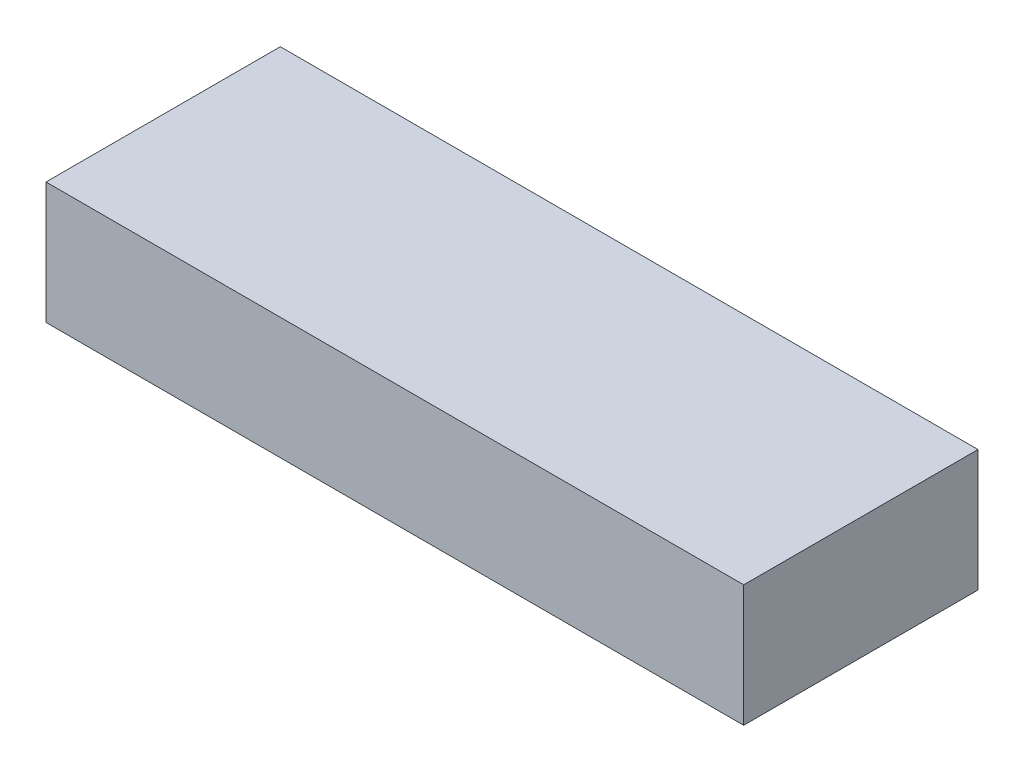
ISO-10303-21;
HEADER;
FILE_DESCRIPTION(('STEP AP214'),'2;1');
FILE_NAME('part.step','',(''),(''),'','','');
FILE_SCHEMA(('AUTOMOTIVE_DESIGN { 1 0 10303 214 1 1 1 1 }'));
ENDSEC;
DATA;
#1=APPLICATION_CONTEXT('core data for automotive mechanical design processes');
#2=APPLICATION_PROTOCOL_DEFINITION('international standard','automotive_design',2000,#1);
#3=PRODUCT_CONTEXT('',#1,'mechanical');
#4=PRODUCT('Part','Part','',(#3));
#5=PRODUCT_RELATED_PRODUCT_CATEGORY('part','',(#4));
#6=PRODUCT_DEFINITION_FORMATION('','',#4);
#7=PRODUCT_DEFINITION_CONTEXT('part definition',#1,'design');
#8=PRODUCT_DEFINITION('design','',#6,#7);
#9=PRODUCT_DEFINITION_SHAPE('','',#8);
#10=(LENGTH_UNIT() NAMED_UNIT(*) SI_UNIT(.MILLI.,.METRE.));
#11=(NAMED_UNIT(*) PLANE_ANGLE_UNIT() SI_UNIT($,.RADIAN.));
#12=(NAMED_UNIT(*) SI_UNIT($,.STERADIAN.) SOLID_ANGLE_UNIT());
#13=UNCERTAINTY_MEASURE_WITH_UNIT(LENGTH_MEASURE(1.E-05),#10,'distance_accuracy_value','');
#14=(GEOMETRIC_REPRESENTATION_CONTEXT(3) GLOBAL_UNCERTAINTY_ASSIGNED_CONTEXT((#13)) GLOBAL_UNIT_ASSIGNED_CONTEXT((#10,
#11,#12)) REPRESENTATION_CONTEXT('',''));
#15=CARTESIAN_POINT('',(0.,0.,0.));
#16=DIRECTION('',(0.,0.,1.));
#17=DIRECTION('',(1.,0.,0.));
#18=AXIS2_PLACEMENT_3D('',#15,#16,#17);
#19=CARTESIAN_POINT('',(68.453,23.876,-22.987));
#20=DIRECTION('',(-1.,0.,0.));
#21=DIRECTION('',(0.,0.,1.));
#22=AXIS2_PLACEMENT_3D('',#19,#20,#21);
#23=PLANE('',#22);
#24=DIRECTION('',(0.,0.,-1.));
#25=VECTOR('',#24,1.);
#26=CARTESIAN_POINT('',(68.453,0.,-22.987));
#27=LINE('',#26,#25);
#28=CARTESIAN_POINT('',(68.453,0.,22.987));
#29=VERTEX_POINT('',#28);
#30=CARTESIAN_POINT('',(68.453,0.,-22.987));
#31=VERTEX_POINT('',#30);
#32=EDGE_CURVE('E107',#29,#31,#27,.T.);
#33=ORIENTED_EDGE('',*,*,#32,.T.);
#34=DIRECTION('',(0.,-1.,0.));
#35=VECTOR('',#34,1.);
#36=CARTESIAN_POINT('',(68.453,23.876,-22.987));
#37=LINE('',#36,#35);
#38=CARTESIAN_POINT('',(68.453,23.876,-22.987));
#39=VERTEX_POINT('',#38);
#40=EDGE_CURVE('E11',#39,#31,#37,.T.);
#41=ORIENTED_EDGE('',*,*,#40,.F.);
#42=DIRECTION('',(0.,0.,-1.));
#43=VECTOR('',#42,1.);
#44=CARTESIAN_POINT('',(68.453,23.876,-22.987));
#45=LINE('',#44,#43);
#46=CARTESIAN_POINT('',(68.453,23.876,22.987));
#47=VERTEX_POINT('',#46);
#48=EDGE_CURVE('E91',#47,#39,#45,.T.);
#49=ORIENTED_EDGE('',*,*,#48,.F.);
#50=DIRECTION('',(0.,-1.,0.));
#51=VECTOR('',#50,1.);
#52=CARTESIAN_POINT('',(68.453,23.876,22.987));
#53=LINE('',#52,#51);
#54=EDGE_CURVE('E103',#47,#29,#53,.T.);
#55=ORIENTED_EDGE('',*,*,#54,.T.);
#56=EDGE_LOOP('',(#33,#41,#49,#55));
#57=FACE_BOUND('',#56,.T.);
#58=ADVANCED_FACE('F39',(#57),#23,.F.);
#59=CARTESIAN_POINT('',(-68.453,23.876,-22.987));
#60=DIRECTION('',(0.,0.,1.));
#61=DIRECTION('',(1.,0.,0.));
#62=AXIS2_PLACEMENT_3D('',#59,#60,#61);
#63=PLANE('',#62);
#64=DIRECTION('',(-1.,0.,0.));
#65=VECTOR('',#64,1.);
#66=CARTESIAN_POINT('',(-68.453,0.,-22.987));
#67=LINE('',#66,#65);
#68=CARTESIAN_POINT('',(-68.453,0.,-22.987));
#69=VERTEX_POINT('',#68);
#70=EDGE_CURVE('E96',#31,#69,#67,.T.);
#71=ORIENTED_EDGE('',*,*,#70,.T.);
#72=DIRECTION('',(0.,-1.,0.));
#73=VECTOR('',#72,1.);
#74=CARTESIAN_POINT('',(-68.453,23.876,-22.987));
#75=LINE('',#74,#73);
#76=CARTESIAN_POINT('',(-68.453,23.876,-22.987));
#77=VERTEX_POINT('',#76);
#78=EDGE_CURVE('E48',#77,#69,#75,.T.);
#79=ORIENTED_EDGE('',*,*,#78,.F.);
#80=DIRECTION('',(-1.,0.,0.));
#81=VECTOR('',#80,1.);
#82=CARTESIAN_POINT('',(-68.453,23.876,-22.987));
#83=LINE('',#82,#81);
#84=EDGE_CURVE('E86',#39,#77,#83,.T.);
#85=ORIENTED_EDGE('',*,*,#84,.F.);
#86=ORIENTED_EDGE('',*,*,#40,.T.);
#87=EDGE_LOOP('',(#71,#79,#85,#86));
#88=FACE_BOUND('',#87,.T.);
#89=ADVANCED_FACE('F95',(#88),#63,.F.);
#90=CARTESIAN_POINT('',(-68.453,23.876,-22.987));
#91=DIRECTION('',(1.,0.,0.));
#92=DIRECTION('',(0.,0.,-1.));
#93=AXIS2_PLACEMENT_3D('',#90,#91,#92);
#94=PLANE('',#93);
#95=DIRECTION('',(0.,0.,1.));
#96=VECTOR('',#95,1.);
#97=CARTESIAN_POINT('',(-68.453,0.,-22.987));
#98=LINE('',#97,#96);
#99=CARTESIAN_POINT('',(-68.453,0.,22.987));
#100=VERTEX_POINT('',#99);
#101=EDGE_CURVE('E73',#69,#100,#98,.T.);
#102=ORIENTED_EDGE('',*,*,#101,.T.);
#103=DIRECTION('',(0.,-1.,0.));
#104=VECTOR('',#103,1.);
#105=CARTESIAN_POINT('',(-68.453,23.876,22.987));
#106=LINE('',#105,#104);
#107=CARTESIAN_POINT('',(-68.453,23.876,22.987));
#108=VERTEX_POINT('',#107);
#109=EDGE_CURVE('E98',#108,#100,#106,.T.);
#110=ORIENTED_EDGE('',*,*,#109,.F.);
#111=DIRECTION('',(0.,0.,1.));
#112=VECTOR('',#111,1.);
#113=CARTESIAN_POINT('',(-68.453,23.876,-22.987));
#114=LINE('',#113,#112);
#115=EDGE_CURVE('E89',#77,#108,#114,.T.);
#116=ORIENTED_EDGE('',*,*,#115,.F.);
#117=ORIENTED_EDGE('',*,*,#78,.T.);
#118=EDGE_LOOP('',(#102,#110,#116,#117));
#119=FACE_BOUND('',#118,.T.);
#120=ADVANCED_FACE('F99',(#119),#94,.F.);
#121=CARTESIAN_POINT('',(-68.453,23.876,22.987));
#122=DIRECTION('',(0.,0.,-1.));
#123=DIRECTION('',(-1.,0.,0.));
#124=AXIS2_PLACEMENT_3D('',#121,#122,#123);
#125=PLANE('',#124);
#126=DIRECTION('',(1.,0.,0.));
#127=VECTOR('',#126,1.);
#128=CARTESIAN_POINT('',(-68.453,0.,22.987));
#129=LINE('',#128,#127);
#130=EDGE_CURVE('E79',#100,#29,#129,.T.);
#131=ORIENTED_EDGE('',*,*,#130,.T.);
#132=ORIENTED_EDGE('',*,*,#54,.F.);
#133=DIRECTION('',(1.,0.,0.));
#134=VECTOR('',#133,1.);
#135=CARTESIAN_POINT('',(-68.453,23.876,22.987));
#136=LINE('',#135,#134);
#137=EDGE_CURVE('E56',#108,#47,#136,.T.);
#138=ORIENTED_EDGE('',*,*,#137,.F.);
#139=ORIENTED_EDGE('',*,*,#109,.T.);
#140=EDGE_LOOP('',(#131,#132,#138,#139));
#141=FACE_BOUND('',#140,.T.);
#142=ADVANCED_FACE('F120',(#141),#125,.F.);
#143=CARTESIAN_POINT('',(0.,23.876,0.));
#144=DIRECTION('',(0.,1.,0.));
#145=DIRECTION('',(0.,0.,1.));
#146=AXIS2_PLACEMENT_3D('',#143,#144,#145);
#147=PLANE('',#146);
#148=ORIENTED_EDGE('',*,*,#48,.T.);
#149=ORIENTED_EDGE('',*,*,#84,.T.);
#150=ORIENTED_EDGE('',*,*,#115,.T.);
#151=ORIENTED_EDGE('',*,*,#137,.T.);
#152=EDGE_LOOP('',(#148,#149,#150,#151));
#153=FACE_BOUND('',#152,.T.);
#154=ADVANCED_FACE('F87',(#153),#147,.T.);
#155=CARTESIAN_POINT('',(0.,0.,0.));
#156=DIRECTION('',(0.,1.,0.));
#157=DIRECTION('',(0.,0.,1.));
#158=AXIS2_PLACEMENT_3D('',#155,#156,#157);
#159=PLANE('',#158);
#160=ORIENTED_EDGE('',*,*,#32,.F.);
#161=ORIENTED_EDGE('',*,*,#130,.F.);
#162=ORIENTED_EDGE('',*,*,#101,.F.);
#163=ORIENTED_EDGE('',*,*,#70,.F.);
#164=EDGE_LOOP('',(#160,#161,#162,#163));
#165=FACE_BOUND('',#164,.T.);
#166=ADVANCED_FACE('F123',(#165),#159,.F.);
#167=CLOSED_SHELL('',(#58,#89,#120,#142,#154,#166));
#168=MANIFOLD_SOLID_BREP('B2',#167);
#169=ADVANCED_BREP_SHAPE_REPRESENTATION('',(#18,#168),#14);
#170=SHAPE_DEFINITION_REPRESENTATION(#9,#169);
ENDSEC;
END-ISO-10303-21;
